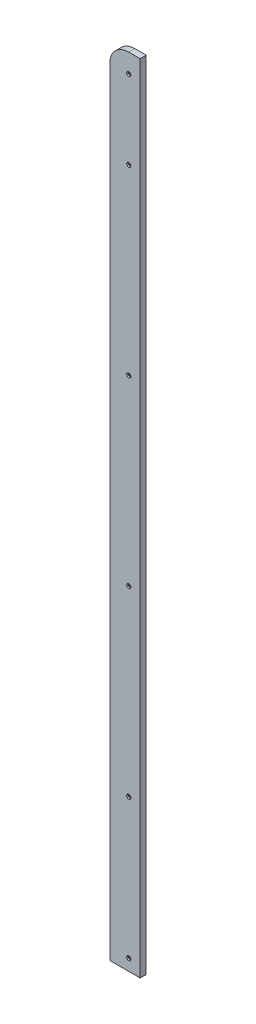
ISO-10303-21;
HEADER;
FILE_DESCRIPTION(('STEP AP214'),'2;1');
FILE_NAME('part.step','',(''),(''),'','','');
FILE_SCHEMA(('AUTOMOTIVE_DESIGN { 1 0 10303 214 1 1 1 1 }'));
ENDSEC;
DATA;
#1=APPLICATION_CONTEXT('core data for automotive mechanical design processes');
#2=APPLICATION_PROTOCOL_DEFINITION('international standard','automotive_design',2000,#1);
#3=PRODUCT_CONTEXT('',#1,'mechanical');
#4=PRODUCT('Part','Part','',(#3));
#5=PRODUCT_RELATED_PRODUCT_CATEGORY('part','',(#4));
#6=PRODUCT_DEFINITION_FORMATION('','',#4);
#7=PRODUCT_DEFINITION_CONTEXT('part definition',#1,'design');
#8=PRODUCT_DEFINITION('design','',#6,#7);
#9=PRODUCT_DEFINITION_SHAPE('','',#8);
#10=(LENGTH_UNIT() NAMED_UNIT(*) SI_UNIT(.MILLI.,.METRE.));
#11=(NAMED_UNIT(*) PLANE_ANGLE_UNIT() SI_UNIT($,.RADIAN.));
#12=(NAMED_UNIT(*) SI_UNIT($,.STERADIAN.) SOLID_ANGLE_UNIT());
#13=UNCERTAINTY_MEASURE_WITH_UNIT(LENGTH_MEASURE(1.E-05),#10,'distance_accuracy_value','');
#14=(GEOMETRIC_REPRESENTATION_CONTEXT(3) GLOBAL_UNCERTAINTY_ASSIGNED_CONTEXT((#13)) GLOBAL_UNIT_ASSIGNED_CONTEXT((#10,
#11,#12)) REPRESENTATION_CONTEXT('',''));
#15=CARTESIAN_POINT('',(0.,0.,0.));
#16=DIRECTION('',(0.,0.,1.));
#17=DIRECTION('',(1.,0.,0.));
#18=AXIS2_PLACEMENT_3D('',#15,#16,#17);
#19=CARTESIAN_POINT('',(186.,-6.50000000000004,8.));
#20=DIRECTION('',(0.,0.,-1.));
#21=DIRECTION('',(-1.,0.,0.));
#22=AXIS2_PLACEMENT_3D('',#19,#20,#21);
#23=CYLINDRICAL_SURFACE('',#22,25.);
#24=CARTESIAN_POINT('',(186.,-6.50000000000004,0.));
#25=DIRECTION('',(0.,0.,1.));
#26=DIRECTION('',(1.,0.,0.));
#27=AXIS2_PLACEMENT_3D('',#24,#25,#26);
#28=CIRCLE('',#27,25.);
#29=CARTESIAN_POINT('',(186.,18.5,0.));
#30=VERTEX_POINT('',#29);
#31=CARTESIAN_POINT('',(161.,-6.50000000000005,0.));
#32=VERTEX_POINT('',#31);
#33=EDGE_CURVE('E106',#30,#32,#28,.T.);
#34=ORIENTED_EDGE('',*,*,#33,.T.);
#35=DIRECTION('',(0.,0.,-1.));
#36=VECTOR('',#35,1.);
#37=CARTESIAN_POINT('',(161.,-6.50000000000005,8.));
#38=LINE('',#37,#36);
#39=CARTESIAN_POINT('',(161.,-6.50000000000005,8.));
#40=VERTEX_POINT('',#39);
#41=EDGE_CURVE('E11',#40,#32,#38,.T.);
#42=ORIENTED_EDGE('',*,*,#41,.F.);
#43=CARTESIAN_POINT('',(186.,-6.50000000000004,8.));
#44=DIRECTION('',(0.,0.,1.));
#45=DIRECTION('',(1.,0.,0.));
#46=AXIS2_PLACEMENT_3D('',#43,#44,#45);
#47=CIRCLE('',#46,25.);
#48=CARTESIAN_POINT('',(186.,18.5,8.));
#49=VERTEX_POINT('',#48);
#50=EDGE_CURVE('E117',#49,#40,#47,.T.);
#51=ORIENTED_EDGE('',*,*,#50,.F.);
#52=DIRECTION('',(0.,0.,-1.));
#53=VECTOR('',#52,1.);
#54=CARTESIAN_POINT('',(186.,18.5,8.));
#55=LINE('',#54,#53);
#56=EDGE_CURVE('E102',#49,#30,#55,.T.);
#57=ORIENTED_EDGE('',*,*,#56,.T.);
#58=EDGE_LOOP('',(#34,#42,#51,#57));
#59=FACE_BOUND('',#58,.T.);
#60=ADVANCED_FACE('F34',(#59),#23,.T.);
#61=CARTESIAN_POINT('',(161.,-6.50000000000005,8.));
#62=DIRECTION('',(1.,0.,0.));
#63=DIRECTION('',(0.,1.,0.));
#64=AXIS2_PLACEMENT_3D('',#61,#62,#63);
#65=PLANE('',#64);
#66=DIRECTION('',(0.,-1.,0.));
#67=VECTOR('',#66,1.);
#68=CARTESIAN_POINT('',(161.,-6.50000000000005,0.));
#69=LINE('',#68,#67);
#70=CARTESIAN_POINT('',(161.,-1029.,0.));
#71=VERTEX_POINT('',#70);
#72=EDGE_CURVE('E109',#32,#71,#69,.T.);
#73=ORIENTED_EDGE('',*,*,#72,.T.);
#74=DIRECTION('',(0.,0.,-1.));
#75=VECTOR('',#74,1.);
#76=CARTESIAN_POINT('',(161.,-1029.,8.));
#77=LINE('',#76,#75);
#78=CARTESIAN_POINT('',(161.,-1029.,8.));
#79=VERTEX_POINT('',#78);
#80=EDGE_CURVE('E42',#79,#71,#77,.T.);
#81=ORIENTED_EDGE('',*,*,#80,.F.);
#82=DIRECTION('',(0.,-1.,0.));
#83=VECTOR('',#82,1.);
#84=CARTESIAN_POINT('',(161.,-6.50000000000005,8.));
#85=LINE('',#84,#83);
#86=EDGE_CURVE('E80',#40,#79,#85,.T.);
#87=ORIENTED_EDGE('',*,*,#86,.F.);
#88=ORIENTED_EDGE('',*,*,#41,.T.);
#89=EDGE_LOOP('',(#73,#81,#87,#88));
#90=FACE_BOUND('',#89,.T.);
#91=ADVANCED_FACE('F119',(#90),#65,.F.);
#92=CARTESIAN_POINT('',(201.,-1029.,8.));
#93=DIRECTION('',(0.,-1.,0.));
#94=DIRECTION('',(0.,0.,-1.));
#95=AXIS2_PLACEMENT_3D('',#92,#93,#94);
#96=PLANE('',#95);
#97=DIRECTION('',(-1.,0.,0.));
#98=VECTOR('',#97,1.);
#99=CARTESIAN_POINT('',(201.,-1029.,0.));
#100=LINE('',#99,#98);
#101=CARTESIAN_POINT('',(201.,-1029.,0.));
#102=VERTEX_POINT('',#101);
#103=EDGE_CURVE('E91',#102,#71,#100,.T.);
#104=ORIENTED_EDGE('',*,*,#103,.F.);
#105=DIRECTION('',(0.,0.,-1.));
#106=VECTOR('',#105,1.);
#107=CARTESIAN_POINT('',(201.,-1029.,8.));
#108=LINE('',#107,#106);
#109=CARTESIAN_POINT('',(201.,-1029.,8.));
#110=VERTEX_POINT('',#109);
#111=EDGE_CURVE('E86',#110,#102,#108,.T.);
#112=ORIENTED_EDGE('',*,*,#111,.F.);
#113=DIRECTION('',(-1.,0.,0.));
#114=VECTOR('',#113,1.);
#115=CARTESIAN_POINT('',(201.,-1029.,8.));
#116=LINE('',#115,#114);
#117=EDGE_CURVE('E89',#110,#79,#116,.T.);
#118=ORIENTED_EDGE('',*,*,#117,.T.);
#119=ORIENTED_EDGE('',*,*,#80,.T.);
#120=EDGE_LOOP('',(#104,#112,#118,#119));
#121=FACE_BOUND('',#120,.T.);
#122=ADVANCED_FACE('F88',(#121),#96,.T.);
#123=CARTESIAN_POINT('',(201.,18.5,8.));
#124=DIRECTION('',(1.,0.,0.));
#125=DIRECTION('',(0.,0.,-1.));
#126=AXIS2_PLACEMENT_3D('',#123,#124,#125);
#127=PLANE('',#126);
#128=DIRECTION('',(0.,-1.,0.));
#129=VECTOR('',#128,1.);
#130=CARTESIAN_POINT('',(201.,18.5,0.));
#131=LINE('',#130,#129);
#132=CARTESIAN_POINT('',(201.,18.5,0.));
#133=VERTEX_POINT('',#132);
#134=EDGE_CURVE('E114',#133,#102,#131,.T.);
#135=ORIENTED_EDGE('',*,*,#134,.F.);
#136=DIRECTION('',(0.,0.,-1.));
#137=VECTOR('',#136,1.);
#138=CARTESIAN_POINT('',(201.,18.5,8.));
#139=LINE('',#138,#137);
#140=CARTESIAN_POINT('',(201.,18.5,8.));
#141=VERTEX_POINT('',#140);
#142=EDGE_CURVE('E69',#141,#133,#139,.T.);
#143=ORIENTED_EDGE('',*,*,#142,.F.);
#144=DIRECTION('',(0.,-1.,0.));
#145=VECTOR('',#144,1.);
#146=CARTESIAN_POINT('',(201.,18.5,8.));
#147=LINE('',#146,#145);
#148=EDGE_CURVE('E98',#141,#110,#147,.T.);
#149=ORIENTED_EDGE('',*,*,#148,.T.);
#150=ORIENTED_EDGE('',*,*,#111,.T.);
#151=EDGE_LOOP('',(#135,#143,#149,#150));
#152=FACE_BOUND('',#151,.T.);
#153=ADVANCED_FACE('F100',(#152),#127,.T.);
#154=CARTESIAN_POINT('',(201.,18.5,8.));
#155=DIRECTION('',(0.,-1.,0.));
#156=DIRECTION('',(0.,0.,-1.));
#157=AXIS2_PLACEMENT_3D('',#154,#155,#156);
#158=PLANE('',#157);
#159=DIRECTION('',(-1.,0.,0.));
#160=VECTOR('',#159,1.);
#161=CARTESIAN_POINT('',(201.,18.5,0.));
#162=LINE('',#161,#160);
#163=EDGE_CURVE('E72',#133,#30,#162,.T.);
#164=ORIENTED_EDGE('',*,*,#163,.T.);
#165=ORIENTED_EDGE('',*,*,#56,.F.);
#166=DIRECTION('',(-1.,0.,0.));
#167=VECTOR('',#166,1.);
#168=CARTESIAN_POINT('',(201.,18.5,8.));
#169=LINE('',#168,#167);
#170=EDGE_CURVE('E50',#141,#49,#169,.T.);
#171=ORIENTED_EDGE('',*,*,#170,.F.);
#172=ORIENTED_EDGE('',*,*,#142,.T.);
#173=EDGE_LOOP('',(#164,#165,#171,#172));
#174=FACE_BOUND('',#173,.T.);
#175=ADVANCED_FACE('F126',(#174),#158,.F.);
#176=CARTESIAN_POINT('',(186.,-6.50000000000004,8.));
#177=DIRECTION('',(0.,0.,1.));
#178=DIRECTION('',(1.,0.,0.));
#179=AXIS2_PLACEMENT_3D('',#176,#177,#178);
#180=PLANE('',#179);
#181=CARTESIAN_POINT('',(186.,-1014.,8.));
#182=DIRECTION('',(0.,0.,1.));
#183=DIRECTION('',(1.,0.,0.));
#184=AXIS2_PLACEMENT_3D('',#181,#182,#183);
#185=CIRCLE('',#184,2.75);
#186=CARTESIAN_POINT('',(188.75,-1014.,8.));
#187=VERTEX_POINT('',#186);
#188=EDGE_CURVE('E359',#187,#187,#185,.T.);
#189=ORIENTED_EDGE('',*,*,#188,.F.);
#190=EDGE_LOOP('',(#189));
#191=FACE_BOUND('',#190,.T.);
#192=CARTESIAN_POINT('',(186.,-830.,8.));
#193=DIRECTION('',(0.,0.,1.));
#194=DIRECTION('',(1.,0.,0.));
#195=AXIS2_PLACEMENT_3D('',#192,#193,#194);
#196=CIRCLE('',#195,2.75);
#197=CARTESIAN_POINT('',(188.75,-830.,8.));
#198=VERTEX_POINT('',#197);
#199=EDGE_CURVE('E369',#198,#198,#196,.T.);
#200=ORIENTED_EDGE('',*,*,#199,.F.);
#201=EDGE_LOOP('',(#200));
#202=FACE_BOUND('',#201,.T.);
#203=CARTESIAN_POINT('',(186.,-590.,8.));
#204=DIRECTION('',(0.,0.,1.));
#205=DIRECTION('',(1.,0.,0.));
#206=AXIS2_PLACEMENT_3D('',#203,#204,#205);
#207=CIRCLE('',#206,2.75);
#208=CARTESIAN_POINT('',(188.75,-590.,8.));
#209=VERTEX_POINT('',#208);
#210=EDGE_CURVE('E381',#209,#209,#207,.T.);
#211=ORIENTED_EDGE('',*,*,#210,.F.);
#212=EDGE_LOOP('',(#211));
#213=FACE_BOUND('',#212,.T.);
#214=CARTESIAN_POINT('',(186.,-350.,8.));
#215=DIRECTION('',(0.,0.,1.));
#216=DIRECTION('',(1.,0.,0.));
#217=AXIS2_PLACEMENT_3D('',#214,#215,#216);
#218=CIRCLE('',#217,2.75);
#219=CARTESIAN_POINT('',(188.75,-350.,8.));
#220=VERTEX_POINT('',#219);
#221=EDGE_CURVE('E393',#220,#220,#218,.T.);
#222=ORIENTED_EDGE('',*,*,#221,.F.);
#223=EDGE_LOOP('',(#222));
#224=FACE_BOUND('',#223,.T.);
#225=CARTESIAN_POINT('',(186.,-110.,8.));
#226=DIRECTION('',(0.,0.,1.));
#227=DIRECTION('',(1.,0.,0.));
#228=AXIS2_PLACEMENT_3D('',#225,#226,#227);
#229=CIRCLE('',#228,2.75);
#230=CARTESIAN_POINT('',(188.75,-110.,8.));
#231=VERTEX_POINT('',#230);
#232=EDGE_CURVE('E405',#231,#231,#229,.T.);
#233=ORIENTED_EDGE('',*,*,#232,.F.);
#234=EDGE_LOOP('',(#233));
#235=FACE_BOUND('',#234,.T.);
#236=CARTESIAN_POINT('',(186.,-6.50000000000004,8.));
#237=DIRECTION('',(0.,0.,1.));
#238=DIRECTION('',(1.,0.,0.));
#239=AXIS2_PLACEMENT_3D('',#236,#237,#238);
#240=CIRCLE('',#239,2.75);
#241=CARTESIAN_POINT('',(188.75,-6.50000000000004,8.));
#242=VERTEX_POINT('',#241);
#243=EDGE_CURVE('E417',#242,#242,#240,.T.);
#244=ORIENTED_EDGE('',*,*,#243,.F.);
#245=EDGE_LOOP('',(#244));
#246=FACE_BOUND('',#245,.T.);
#247=ORIENTED_EDGE('',*,*,#50,.T.);
#248=ORIENTED_EDGE('',*,*,#86,.T.);
#249=ORIENTED_EDGE('',*,*,#117,.F.);
#250=ORIENTED_EDGE('',*,*,#148,.F.);
#251=ORIENTED_EDGE('',*,*,#170,.T.);
#252=EDGE_LOOP('',(#247,#248,#249,#250,#251));
#253=FACE_BOUND('',#252,.T.);
#254=ADVANCED_FACE('F97',(#191,#202,#213,#224,#235,#246,#253),#180,.T.);
#255=CARTESIAN_POINT('',(186.,-6.50000000000004,0.));
#256=DIRECTION('',(0.,0.,1.));
#257=DIRECTION('',(1.,0.,0.));
#258=AXIS2_PLACEMENT_3D('',#255,#256,#257);
#259=PLANE('',#258);
#260=CARTESIAN_POINT('',(186.,-1014.,0.));
#261=DIRECTION('',(0.,0.,1.));
#262=DIRECTION('',(1.,0.,0.));
#263=AXIS2_PLACEMENT_3D('',#260,#261,#262);
#264=CIRCLE('',#263,1.5);
#265=CARTESIAN_POINT('',(187.5,-1014.,0.));
#266=VERTEX_POINT('',#265);
#267=EDGE_CURVE('E366',#266,#266,#264,.T.);
#268=ORIENTED_EDGE('',*,*,#267,.T.);
#269=EDGE_LOOP('',(#268));
#270=FACE_BOUND('',#269,.T.);
#271=CARTESIAN_POINT('',(186.,-830.,0.));
#272=DIRECTION('',(0.,0.,1.));
#273=DIRECTION('',(1.,0.,0.));
#274=AXIS2_PLACEMENT_3D('',#271,#272,#273);
#275=CIRCLE('',#274,1.5);
#276=CARTESIAN_POINT('',(187.5,-830.,0.));
#277=VERTEX_POINT('',#276);
#278=EDGE_CURVE('E378',#277,#277,#275,.T.);
#279=ORIENTED_EDGE('',*,*,#278,.T.);
#280=EDGE_LOOP('',(#279));
#281=FACE_BOUND('',#280,.T.);
#282=CARTESIAN_POINT('',(186.,-590.,0.));
#283=DIRECTION('',(0.,0.,1.));
#284=DIRECTION('',(1.,0.,0.));
#285=AXIS2_PLACEMENT_3D('',#282,#283,#284);
#286=CIRCLE('',#285,1.5);
#287=CARTESIAN_POINT('',(187.5,-590.,0.));
#288=VERTEX_POINT('',#287);
#289=EDGE_CURVE('E390',#288,#288,#286,.T.);
#290=ORIENTED_EDGE('',*,*,#289,.T.);
#291=EDGE_LOOP('',(#290));
#292=FACE_BOUND('',#291,.T.);
#293=CARTESIAN_POINT('',(186.,-350.,0.));
#294=DIRECTION('',(0.,0.,1.));
#295=DIRECTION('',(1.,0.,0.));
#296=AXIS2_PLACEMENT_3D('',#293,#294,#295);
#297=CIRCLE('',#296,1.5);
#298=CARTESIAN_POINT('',(187.5,-350.,0.));
#299=VERTEX_POINT('',#298);
#300=EDGE_CURVE('E402',#299,#299,#297,.T.);
#301=ORIENTED_EDGE('',*,*,#300,.T.);
#302=EDGE_LOOP('',(#301));
#303=FACE_BOUND('',#302,.T.);
#304=CARTESIAN_POINT('',(186.,-110.,0.));
#305=DIRECTION('',(0.,0.,1.));
#306=DIRECTION('',(1.,0.,0.));
#307=AXIS2_PLACEMENT_3D('',#304,#305,#306);
#308=CIRCLE('',#307,1.5);
#309=CARTESIAN_POINT('',(187.5,-110.,0.));
#310=VERTEX_POINT('',#309);
#311=EDGE_CURVE('E414',#310,#310,#308,.T.);
#312=ORIENTED_EDGE('',*,*,#311,.T.);
#313=EDGE_LOOP('',(#312));
#314=FACE_BOUND('',#313,.T.);
#315=CARTESIAN_POINT('',(186.,-6.50000000000004,0.));
#316=DIRECTION('',(0.,0.,1.));
#317=DIRECTION('',(1.,0.,0.));
#318=AXIS2_PLACEMENT_3D('',#315,#316,#317);
#319=CIRCLE('',#318,1.5);
#320=CARTESIAN_POINT('',(187.5,-6.50000000000004,0.));
#321=VERTEX_POINT('',#320);
#322=EDGE_CURVE('E110',#321,#321,#319,.T.);
#323=ORIENTED_EDGE('',*,*,#322,.T.);
#324=EDGE_LOOP('',(#323));
#325=FACE_BOUND('',#324,.T.);
#326=ORIENTED_EDGE('',*,*,#33,.F.);
#327=ORIENTED_EDGE('',*,*,#163,.F.);
#328=ORIENTED_EDGE('',*,*,#134,.T.);
#329=ORIENTED_EDGE('',*,*,#103,.T.);
#330=ORIENTED_EDGE('',*,*,#72,.F.);
#331=EDGE_LOOP('',(#326,#327,#328,#329,#330));
#332=FACE_BOUND('',#331,.T.);
#333=ADVANCED_FACE('F123',(#270,#281,#292,#303,#314,#325,#332),#259,.F.);
#334=CARTESIAN_POINT('',(186.,-6.50000000000004,8.));
#335=DIRECTION('',(0.,0.,1.));
#336=DIRECTION('',(1.,0.,0.));
#337=AXIS2_PLACEMENT_3D('',#334,#335,#336);
#338=CYLINDRICAL_SURFACE('',#337,1.5);
#339=ORIENTED_EDGE('',*,*,#322,.F.);
#340=EDGE_LOOP('',(#339));
#341=FACE_BOUND('',#340,.T.);
#342=CARTESIAN_POINT('',(186.,-6.50000000000004,6.));
#343=DIRECTION('',(0.,0.,1.));
#344=DIRECTION('',(1.,0.,0.));
#345=AXIS2_PLACEMENT_3D('',#342,#343,#344);
#346=CIRCLE('',#345,1.5);
#347=CARTESIAN_POINT('',(187.5,-6.50000000000004,6.));
#348=VERTEX_POINT('',#347);
#349=EDGE_CURVE('E423',#348,#348,#346,.T.);
#350=ORIENTED_EDGE('',*,*,#349,.T.);
#351=EDGE_LOOP('',(#350));
#352=FACE_BOUND('',#351,.T.);
#353=ADVANCED_FACE('F170',(#341,#352),#338,.F.);
#354=CARTESIAN_POINT('',(187.5,-6.50000000000004,6.));
#355=DIRECTION('',(0.,0.,-1.));
#356=DIRECTION('',(-1.,0.,0.));
#357=AXIS2_PLACEMENT_3D('',#354,#355,#356);
#358=PLANE('',#357);
#359=ORIENTED_EDGE('',*,*,#349,.F.);
#360=EDGE_LOOP('',(#359));
#361=FACE_BOUND('',#360,.T.);
#362=CARTESIAN_POINT('',(186.,-6.50000000000004,6.));
#363=DIRECTION('',(0.,0.,1.));
#364=DIRECTION('',(1.,0.,0.));
#365=AXIS2_PLACEMENT_3D('',#362,#363,#364);
#366=CIRCLE('',#365,2.75);
#367=CARTESIAN_POINT('',(188.75,-6.50000000000004,6.));
#368=VERTEX_POINT('',#367);
#369=EDGE_CURVE('E420',#368,#368,#366,.T.);
#370=ORIENTED_EDGE('',*,*,#369,.T.);
#371=EDGE_LOOP('',(#370));
#372=FACE_BOUND('',#371,.T.);
#373=ADVANCED_FACE('F179',(#361,#372),#358,.F.);
#374=CARTESIAN_POINT('',(186.,-6.50000000000004,8.));
#375=DIRECTION('',(0.,0.,1.));
#376=DIRECTION('',(1.,0.,0.));
#377=AXIS2_PLACEMENT_3D('',#374,#375,#376);
#378=CYLINDRICAL_SURFACE('',#377,2.75);
#379=ORIENTED_EDGE('',*,*,#369,.F.);
#380=EDGE_LOOP('',(#379));
#381=FACE_BOUND('',#380,.T.);
#382=ORIENTED_EDGE('',*,*,#243,.T.);
#383=EDGE_LOOP('',(#382));
#384=FACE_BOUND('',#383,.T.);
#385=ADVANCED_FACE('F189',(#381,#384),#378,.F.);
#386=CARTESIAN_POINT('',(186.,-110.,8.));
#387=DIRECTION('',(0.,0.,1.));
#388=DIRECTION('',(1.,0.,0.));
#389=AXIS2_PLACEMENT_3D('',#386,#387,#388);
#390=CYLINDRICAL_SURFACE('',#389,1.5);
#391=ORIENTED_EDGE('',*,*,#311,.F.);
#392=EDGE_LOOP('',(#391));
#393=FACE_BOUND('',#392,.T.);
#394=CARTESIAN_POINT('',(186.,-110.,6.));
#395=DIRECTION('',(0.,0.,1.));
#396=DIRECTION('',(1.,0.,0.));
#397=AXIS2_PLACEMENT_3D('',#394,#395,#396);
#398=CIRCLE('',#397,1.5);
#399=CARTESIAN_POINT('',(187.5,-110.,6.));
#400=VERTEX_POINT('',#399);
#401=EDGE_CURVE('E411',#400,#400,#398,.T.);
#402=ORIENTED_EDGE('',*,*,#401,.T.);
#403=EDGE_LOOP('',(#402));
#404=FACE_BOUND('',#403,.T.);
#405=ADVANCED_FACE('F199',(#393,#404),#390,.F.);
#406=CARTESIAN_POINT('',(187.5,-110.,6.));
#407=DIRECTION('',(0.,0.,-1.));
#408=DIRECTION('',(-1.,0.,0.));
#409=AXIS2_PLACEMENT_3D('',#406,#407,#408);
#410=PLANE('',#409);
#411=ORIENTED_EDGE('',*,*,#401,.F.);
#412=EDGE_LOOP('',(#411));
#413=FACE_BOUND('',#412,.T.);
#414=CARTESIAN_POINT('',(186.,-110.,6.));
#415=DIRECTION('',(0.,0.,1.));
#416=DIRECTION('',(1.,0.,0.));
#417=AXIS2_PLACEMENT_3D('',#414,#415,#416);
#418=CIRCLE('',#417,2.75);
#419=CARTESIAN_POINT('',(188.75,-110.,6.));
#420=VERTEX_POINT('',#419);
#421=EDGE_CURVE('E408',#420,#420,#418,.T.);
#422=ORIENTED_EDGE('',*,*,#421,.T.);
#423=EDGE_LOOP('',(#422));
#424=FACE_BOUND('',#423,.T.);
#425=ADVANCED_FACE('F209',(#413,#424),#410,.F.);
#426=CARTESIAN_POINT('',(186.,-110.,8.));
#427=DIRECTION('',(0.,0.,1.));
#428=DIRECTION('',(1.,0.,0.));
#429=AXIS2_PLACEMENT_3D('',#426,#427,#428);
#430=CYLINDRICAL_SURFACE('',#429,2.75);
#431=ORIENTED_EDGE('',*,*,#421,.F.);
#432=EDGE_LOOP('',(#431));
#433=FACE_BOUND('',#432,.T.);
#434=ORIENTED_EDGE('',*,*,#232,.T.);
#435=EDGE_LOOP('',(#434));
#436=FACE_BOUND('',#435,.T.);
#437=ADVANCED_FACE('F219',(#433,#436),#430,.F.);
#438=CARTESIAN_POINT('',(186.,-350.,8.));
#439=DIRECTION('',(0.,0.,1.));
#440=DIRECTION('',(1.,0.,0.));
#441=AXIS2_PLACEMENT_3D('',#438,#439,#440);
#442=CYLINDRICAL_SURFACE('',#441,1.5);
#443=ORIENTED_EDGE('',*,*,#300,.F.);
#444=EDGE_LOOP('',(#443));
#445=FACE_BOUND('',#444,.T.);
#446=CARTESIAN_POINT('',(186.,-350.,6.));
#447=DIRECTION('',(0.,0.,1.));
#448=DIRECTION('',(1.,0.,0.));
#449=AXIS2_PLACEMENT_3D('',#446,#447,#448);
#450=CIRCLE('',#449,1.5);
#451=CARTESIAN_POINT('',(187.5,-350.,6.));
#452=VERTEX_POINT('',#451);
#453=EDGE_CURVE('E399',#452,#452,#450,.T.);
#454=ORIENTED_EDGE('',*,*,#453,.T.);
#455=EDGE_LOOP('',(#454));
#456=FACE_BOUND('',#455,.T.);
#457=ADVANCED_FACE('F229',(#445,#456),#442,.F.);
#458=CARTESIAN_POINT('',(187.5,-350.,6.));
#459=DIRECTION('',(0.,0.,-1.));
#460=DIRECTION('',(-1.,0.,0.));
#461=AXIS2_PLACEMENT_3D('',#458,#459,#460);
#462=PLANE('',#461);
#463=ORIENTED_EDGE('',*,*,#453,.F.);
#464=EDGE_LOOP('',(#463));
#465=FACE_BOUND('',#464,.T.);
#466=CARTESIAN_POINT('',(186.,-350.,6.));
#467=DIRECTION('',(0.,0.,1.));
#468=DIRECTION('',(1.,0.,0.));
#469=AXIS2_PLACEMENT_3D('',#466,#467,#468);
#470=CIRCLE('',#469,2.75);
#471=CARTESIAN_POINT('',(188.75,-350.,6.));
#472=VERTEX_POINT('',#471);
#473=EDGE_CURVE('E396',#472,#472,#470,.T.);
#474=ORIENTED_EDGE('',*,*,#473,.T.);
#475=EDGE_LOOP('',(#474));
#476=FACE_BOUND('',#475,.T.);
#477=ADVANCED_FACE('F239',(#465,#476),#462,.F.);
#478=CARTESIAN_POINT('',(186.,-350.,8.));
#479=DIRECTION('',(0.,0.,1.));
#480=DIRECTION('',(1.,0.,0.));
#481=AXIS2_PLACEMENT_3D('',#478,#479,#480);
#482=CYLINDRICAL_SURFACE('',#481,2.75);
#483=ORIENTED_EDGE('',*,*,#473,.F.);
#484=EDGE_LOOP('',(#483));
#485=FACE_BOUND('',#484,.T.);
#486=ORIENTED_EDGE('',*,*,#221,.T.);
#487=EDGE_LOOP('',(#486));
#488=FACE_BOUND('',#487,.T.);
#489=ADVANCED_FACE('F249',(#485,#488),#482,.F.);
#490=CARTESIAN_POINT('',(186.,-590.,8.));
#491=DIRECTION('',(0.,0.,1.));
#492=DIRECTION('',(1.,0.,0.));
#493=AXIS2_PLACEMENT_3D('',#490,#491,#492);
#494=CYLINDRICAL_SURFACE('',#493,1.5);
#495=ORIENTED_EDGE('',*,*,#289,.F.);
#496=EDGE_LOOP('',(#495));
#497=FACE_BOUND('',#496,.T.);
#498=CARTESIAN_POINT('',(186.,-590.,6.));
#499=DIRECTION('',(0.,0.,1.));
#500=DIRECTION('',(1.,0.,0.));
#501=AXIS2_PLACEMENT_3D('',#498,#499,#500);
#502=CIRCLE('',#501,1.5);
#503=CARTESIAN_POINT('',(187.5,-590.,6.));
#504=VERTEX_POINT('',#503);
#505=EDGE_CURVE('E387',#504,#504,#502,.T.);
#506=ORIENTED_EDGE('',*,*,#505,.T.);
#507=EDGE_LOOP('',(#506));
#508=FACE_BOUND('',#507,.T.);
#509=ADVANCED_FACE('F259',(#497,#508),#494,.F.);
#510=CARTESIAN_POINT('',(187.5,-590.,6.));
#511=DIRECTION('',(0.,0.,-1.));
#512=DIRECTION('',(-1.,0.,0.));
#513=AXIS2_PLACEMENT_3D('',#510,#511,#512);
#514=PLANE('',#513);
#515=ORIENTED_EDGE('',*,*,#505,.F.);
#516=EDGE_LOOP('',(#515));
#517=FACE_BOUND('',#516,.T.);
#518=CARTESIAN_POINT('',(186.,-590.,6.));
#519=DIRECTION('',(0.,0.,1.));
#520=DIRECTION('',(1.,0.,0.));
#521=AXIS2_PLACEMENT_3D('',#518,#519,#520);
#522=CIRCLE('',#521,2.75);
#523=CARTESIAN_POINT('',(188.75,-590.,6.));
#524=VERTEX_POINT('',#523);
#525=EDGE_CURVE('E384',#524,#524,#522,.T.);
#526=ORIENTED_EDGE('',*,*,#525,.T.);
#527=EDGE_LOOP('',(#526));
#528=FACE_BOUND('',#527,.T.);
#529=ADVANCED_FACE('F269',(#517,#528),#514,.F.);
#530=CARTESIAN_POINT('',(186.,-590.,8.));
#531=DIRECTION('',(0.,0.,1.));
#532=DIRECTION('',(1.,0.,0.));
#533=AXIS2_PLACEMENT_3D('',#530,#531,#532);
#534=CYLINDRICAL_SURFACE('',#533,2.75);
#535=ORIENTED_EDGE('',*,*,#525,.F.);
#536=EDGE_LOOP('',(#535));
#537=FACE_BOUND('',#536,.T.);
#538=ORIENTED_EDGE('',*,*,#210,.T.);
#539=EDGE_LOOP('',(#538));
#540=FACE_BOUND('',#539,.T.);
#541=ADVANCED_FACE('F279',(#537,#540),#534,.F.);
#542=CARTESIAN_POINT('',(186.,-830.,8.));
#543=DIRECTION('',(0.,0.,1.));
#544=DIRECTION('',(1.,0.,0.));
#545=AXIS2_PLACEMENT_3D('',#542,#543,#544);
#546=CYLINDRICAL_SURFACE('',#545,1.5);
#547=ORIENTED_EDGE('',*,*,#278,.F.);
#548=EDGE_LOOP('',(#547));
#549=FACE_BOUND('',#548,.T.);
#550=CARTESIAN_POINT('',(186.,-830.,6.));
#551=DIRECTION('',(0.,0.,1.));
#552=DIRECTION('',(1.,0.,0.));
#553=AXIS2_PLACEMENT_3D('',#550,#551,#552);
#554=CIRCLE('',#553,1.5);
#555=CARTESIAN_POINT('',(187.5,-830.,6.));
#556=VERTEX_POINT('',#555);
#557=EDGE_CURVE('E375',#556,#556,#554,.T.);
#558=ORIENTED_EDGE('',*,*,#557,.T.);
#559=EDGE_LOOP('',(#558));
#560=FACE_BOUND('',#559,.T.);
#561=ADVANCED_FACE('F289',(#549,#560),#546,.F.);
#562=CARTESIAN_POINT('',(187.5,-830.,6.));
#563=DIRECTION('',(0.,0.,-1.));
#564=DIRECTION('',(-1.,0.,0.));
#565=AXIS2_PLACEMENT_3D('',#562,#563,#564);
#566=PLANE('',#565);
#567=ORIENTED_EDGE('',*,*,#557,.F.);
#568=EDGE_LOOP('',(#567));
#569=FACE_BOUND('',#568,.T.);
#570=CARTESIAN_POINT('',(186.,-830.,6.));
#571=DIRECTION('',(0.,0.,1.));
#572=DIRECTION('',(1.,0.,0.));
#573=AXIS2_PLACEMENT_3D('',#570,#571,#572);
#574=CIRCLE('',#573,2.75);
#575=CARTESIAN_POINT('',(188.75,-830.,6.));
#576=VERTEX_POINT('',#575);
#577=EDGE_CURVE('E372',#576,#576,#574,.T.);
#578=ORIENTED_EDGE('',*,*,#577,.T.);
#579=EDGE_LOOP('',(#578));
#580=FACE_BOUND('',#579,.T.);
#581=ADVANCED_FACE('F299',(#569,#580),#566,.F.);
#582=CARTESIAN_POINT('',(186.,-830.,8.));
#583=DIRECTION('',(0.,0.,1.));
#584=DIRECTION('',(1.,0.,0.));
#585=AXIS2_PLACEMENT_3D('',#582,#583,#584);
#586=CYLINDRICAL_SURFACE('',#585,2.75);
#587=ORIENTED_EDGE('',*,*,#577,.F.);
#588=EDGE_LOOP('',(#587));
#589=FACE_BOUND('',#588,.T.);
#590=ORIENTED_EDGE('',*,*,#199,.T.);
#591=EDGE_LOOP('',(#590));
#592=FACE_BOUND('',#591,.T.);
#593=ADVANCED_FACE('F309',(#589,#592),#586,.F.);
#594=CARTESIAN_POINT('',(186.,-1014.,8.));
#595=DIRECTION('',(0.,0.,1.));
#596=DIRECTION('',(1.,0.,0.));
#597=AXIS2_PLACEMENT_3D('',#594,#595,#596);
#598=CYLINDRICAL_SURFACE('',#597,1.5);
#599=ORIENTED_EDGE('',*,*,#267,.F.);
#600=EDGE_LOOP('',(#599));
#601=FACE_BOUND('',#600,.T.);
#602=CARTESIAN_POINT('',(186.,-1014.,6.));
#603=DIRECTION('',(0.,0.,1.));
#604=DIRECTION('',(1.,0.,0.));
#605=AXIS2_PLACEMENT_3D('',#602,#603,#604);
#606=CIRCLE('',#605,1.5);
#607=CARTESIAN_POINT('',(187.5,-1014.,6.));
#608=VERTEX_POINT('',#607);
#609=EDGE_CURVE('E361',#608,#608,#606,.T.);
#610=ORIENTED_EDGE('',*,*,#609,.T.);
#611=EDGE_LOOP('',(#610));
#612=FACE_BOUND('',#611,.T.);
#613=ADVANCED_FACE('F319',(#601,#612),#598,.F.);
#614=CARTESIAN_POINT('',(187.5,-1014.,6.));
#615=DIRECTION('',(0.,0.,-1.));
#616=DIRECTION('',(-1.,0.,0.));
#617=AXIS2_PLACEMENT_3D('',#614,#615,#616);
#618=PLANE('',#617);
#619=ORIENTED_EDGE('',*,*,#609,.F.);
#620=EDGE_LOOP('',(#619));
#621=FACE_BOUND('',#620,.T.);
#622=CARTESIAN_POINT('',(186.,-1014.,6.));
#623=DIRECTION('',(0.,0.,1.));
#624=DIRECTION('',(1.,0.,0.));
#625=AXIS2_PLACEMENT_3D('',#622,#623,#624);
#626=CIRCLE('',#625,2.75);
#627=CARTESIAN_POINT('',(188.75,-1014.,6.));
#628=VERTEX_POINT('',#627);
#629=EDGE_CURVE('E356',#628,#628,#626,.T.);
#630=ORIENTED_EDGE('',*,*,#629,.T.);
#631=EDGE_LOOP('',(#630));
#632=FACE_BOUND('',#631,.T.);
#633=ADVANCED_FACE('F329',(#621,#632),#618,.F.);
#634=CARTESIAN_POINT('',(186.,-1014.,8.));
#635=DIRECTION('',(0.,0.,1.));
#636=DIRECTION('',(1.,0.,0.));
#637=AXIS2_PLACEMENT_3D('',#634,#635,#636);
#638=CYLINDRICAL_SURFACE('',#637,2.75);
#639=ORIENTED_EDGE('',*,*,#629,.F.);
#640=EDGE_LOOP('',(#639));
#641=FACE_BOUND('',#640,.T.);
#642=ORIENTED_EDGE('',*,*,#188,.T.);
#643=EDGE_LOOP('',(#642));
#644=FACE_BOUND('',#643,.T.);
#645=ADVANCED_FACE('F339',(#641,#644),#638,.F.);
#646=CLOSED_SHELL('',(#60,#91,#122,#153,#175,#254,#333,#353,#373,#385,#405,#425,#437,#457,#477,
#489,#509,#529,#541,#561,#581,#593,#613,#633,#645));
#647=MANIFOLD_SOLID_BREP('B2',#646);
#648=ADVANCED_BREP_SHAPE_REPRESENTATION('',(#18,#647),#14);
#649=SHAPE_DEFINITION_REPRESENTATION(#9,#648);
ENDSEC;
END-ISO-10303-21;
